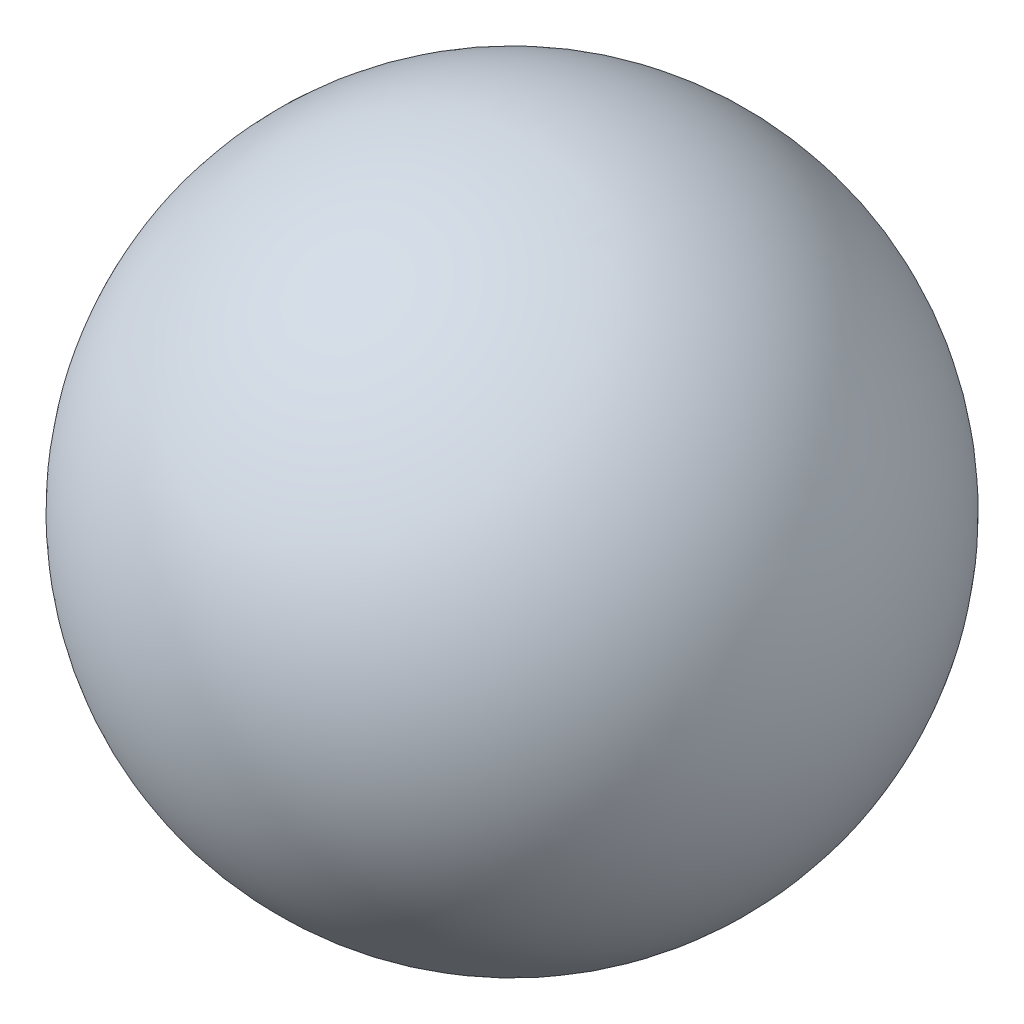
ISO-10303-21;
HEADER;
FILE_DESCRIPTION(('STEP AP214'),'2;1');
FILE_NAME('part.step','',(''),(''),'','','');
FILE_SCHEMA(('AUTOMOTIVE_DESIGN { 1 0 10303 214 1 1 1 1 }'));
ENDSEC;
DATA;
#1=APPLICATION_CONTEXT('core data for automotive mechanical design processes');
#2=APPLICATION_PROTOCOL_DEFINITION('international standard','automotive_design',2000,#1);
#3=PRODUCT_CONTEXT('',#1,'mechanical');
#4=PRODUCT('Part','Part','',(#3));
#5=PRODUCT_RELATED_PRODUCT_CATEGORY('part','',(#4));
#6=PRODUCT_DEFINITION_FORMATION('','',#4);
#7=PRODUCT_DEFINITION_CONTEXT('part definition',#1,'design');
#8=PRODUCT_DEFINITION('design','',#6,#7);
#9=PRODUCT_DEFINITION_SHAPE('','',#8);
#10=(LENGTH_UNIT() NAMED_UNIT(*) SI_UNIT(.MILLI.,.METRE.));
#11=(NAMED_UNIT(*) PLANE_ANGLE_UNIT() SI_UNIT($,.RADIAN.));
#12=(NAMED_UNIT(*) SI_UNIT($,.STERADIAN.) SOLID_ANGLE_UNIT());
#13=UNCERTAINTY_MEASURE_WITH_UNIT(LENGTH_MEASURE(1.E-05),#10,'distance_accuracy_value','');
#14=(GEOMETRIC_REPRESENTATION_CONTEXT(3) GLOBAL_UNCERTAINTY_ASSIGNED_CONTEXT((#13)) GLOBAL_UNIT_ASSIGNED_CONTEXT((#10,
#11,#12)) REPRESENTATION_CONTEXT('',''));
#15=CARTESIAN_POINT('',(0.,0.,0.));
#16=DIRECTION('',(0.,0.,1.));
#17=DIRECTION('',(1.,0.,0.));
#18=AXIS2_PLACEMENT_3D('',#15,#16,#17);
#19=CARTESIAN_POINT('',(9.81371442752064,3.18866911070645,0.));
#20=DIRECTION('',(1.,0.,0.));
#21=DIRECTION('',(0.,1.,0.));
#22=AXIS2_PLACEMENT_3D('',#19,#20,#21);
#23=SPHERICAL_SURFACE('',#22,1.71627890103155);
#24=CARTESIAN_POINT('',(11.5299933285522,3.18866911070645,0.));
#25=VERTEX_POINT('',#24);
#26=VERTEX_LOOP('',#25);
#27=FACE_BOUND('',#26,.T.);
#28=CARTESIAN_POINT('',(8.09743552648909,3.18866911070645,0.));
#29=VERTEX_POINT('',#28);
#30=VERTEX_LOOP('',#29);
#31=FACE_BOUND('',#30,.T.);
#32=ADVANCED_FACE('F16',(#27,#31),#23,.T.);
#33=CLOSED_SHELL('',(#32));
#34=MANIFOLD_SOLID_BREP('B1',#33);
#35=ADVANCED_BREP_SHAPE_REPRESENTATION('',(#18,#34),#14);
#36=SHAPE_DEFINITION_REPRESENTATION(#9,#35);
ENDSEC;
END-ISO-10303-21;
